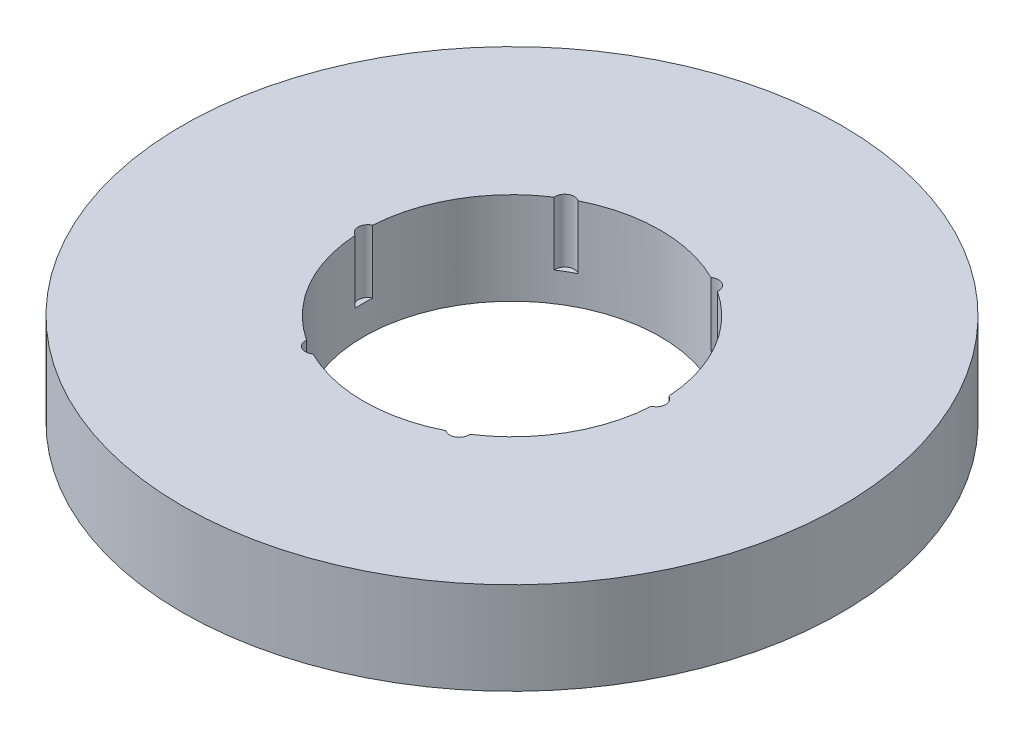
ISO-10303-21;
HEADER;
FILE_DESCRIPTION(('STEP AP214'),'2;1');
FILE_NAME('part.step','',(''),(''),'','','');
FILE_SCHEMA(('AUTOMOTIVE_DESIGN { 1 0 10303 214 1 1 1 1 }'));
ENDSEC;
DATA;
#1=APPLICATION_CONTEXT('core data for automotive mechanical design processes');
#2=APPLICATION_PROTOCOL_DEFINITION('international standard','automotive_design',2000,#1);
#3=PRODUCT_CONTEXT('',#1,'mechanical');
#4=PRODUCT('Part','Part','',(#3));
#5=PRODUCT_RELATED_PRODUCT_CATEGORY('part','',(#4));
#6=PRODUCT_DEFINITION_FORMATION('','',#4);
#7=PRODUCT_DEFINITION_CONTEXT('part definition',#1,'design');
#8=PRODUCT_DEFINITION('design','',#6,#7);
#9=PRODUCT_DEFINITION_SHAPE('','',#8);
#10=(LENGTH_UNIT() NAMED_UNIT(*) SI_UNIT(.MILLI.,.METRE.));
#11=(NAMED_UNIT(*) PLANE_ANGLE_UNIT() SI_UNIT($,.RADIAN.));
#12=(NAMED_UNIT(*) SI_UNIT($,.STERADIAN.) SOLID_ANGLE_UNIT());
#13=UNCERTAINTY_MEASURE_WITH_UNIT(LENGTH_MEASURE(1.E-05),#10,'distance_accuracy_value','');
#14=(GEOMETRIC_REPRESENTATION_CONTEXT(3) GLOBAL_UNCERTAINTY_ASSIGNED_CONTEXT((#13)) GLOBAL_UNIT_ASSIGNED_CONTEXT((#10,
#11,#12)) REPRESENTATION_CONTEXT('',''));
#15=CARTESIAN_POINT('',(0.,0.,0.));
#16=DIRECTION('',(0.,0.,1.));
#17=DIRECTION('',(1.,0.,0.));
#18=AXIS2_PLACEMENT_3D('',#15,#16,#17);
#19=CARTESIAN_POINT('',(0.,28.,0.));
#20=DIRECTION('',(0.,-1.,0.));
#21=DIRECTION('',(0.,0.,-1.));
#22=AXIS2_PLACEMENT_3D('',#19,#20,#21);
#23=CYLINDRICAL_SURFACE('',#22,100.);
#24=CARTESIAN_POINT('',(0.,28.,0.));
#25=DIRECTION('',(0.,1.,0.));
#26=DIRECTION('',(0.,0.,1.));
#27=AXIS2_PLACEMENT_3D('',#24,#25,#26);
#28=CIRCLE('',#27,100.);
#29=CARTESIAN_POINT('',(0.,28.,100.));
#30=VERTEX_POINT('',#29);
#31=EDGE_CURVE('E162',#30,#30,#28,.T.);
#32=ORIENTED_EDGE('',*,*,#31,.F.);
#33=EDGE_LOOP('',(#32));
#34=FACE_BOUND('',#33,.T.);
#35=CARTESIAN_POINT('',(0.,0.,0.));
#36=DIRECTION('',(0.,1.,0.));
#37=DIRECTION('',(0.,0.,1.));
#38=AXIS2_PLACEMENT_3D('',#35,#36,#37);
#39=CIRCLE('',#38,100.);
#40=CARTESIAN_POINT('',(0.,0.,100.));
#41=VERTEX_POINT('',#40);
#42=EDGE_CURVE('E157',#41,#41,#39,.T.);
#43=ORIENTED_EDGE('',*,*,#42,.T.);
#44=EDGE_LOOP('',(#43));
#45=FACE_BOUND('',#44,.T.);
#46=ADVANCED_FACE('F39',(#34,#45),#23,.T.);
#47=CARTESIAN_POINT('',(0.,28.,0.));
#48=DIRECTION('',(0.,1.,0.));
#49=DIRECTION('',(0.,0.,1.));
#50=AXIS2_PLACEMENT_3D('',#47,#48,#49);
#51=PLANE('',#50);
#52=CARTESIAN_POINT('',(-21.8762419223604,28.,-37.8907624881954));
#53=DIRECTION('',(0.,1.,0.));
#54=DIRECTION('',(-0.866025403784433,0.,0.50000000000001));
#55=AXIS2_PLACEMENT_3D('',#52,#53,#54);
#56=CIRCLE('',#55,2.9082454368613);
#57=CARTESIAN_POINT('',(-20.1542428435266,28.,-40.2343944331732));
#58=VERTEX_POINT('',#57);
#59=CARTESIAN_POINT('',(-24.7668862632487,28.,-37.5712835131208));
#60=VERTEX_POINT('',#59);
#61=EDGE_CURVE('E218',#58,#60,#56,.T.);
#62=ORIENTED_EDGE('',*,*,#61,.F.);
#63=CARTESIAN_POINT('',(0.,28.,0.));
#64=DIRECTION('',(0.,1.,0.));
#65=DIRECTION('',(0.,0.,1.));
#66=AXIS2_PLACEMENT_3D('',#63,#64,#65);
#67=CIRCLE('',#66,45.);
#68=CARTESIAN_POINT('',(20.1542428435258,28.,-40.2343944331736));
#69=VERTEX_POINT('',#68);
#70=EDGE_CURVE('E169',#69,#58,#67,.T.);
#71=ORIENTED_EDGE('',*,*,#70,.F.);
#72=CARTESIAN_POINT('',(21.8762419223596,28.,-37.8907624881958));
#73=DIRECTION('',(0.,1.,0.));
#74=DIRECTION('',(-0.866025403784443,0.,-0.499999999999992));
#75=AXIS2_PLACEMENT_3D('',#72,#73,#74);
#76=CIRCLE('',#75,2.9082454368613);
#77=CARTESIAN_POINT('',(24.7668862632479,28.,-37.5712835131213));
#78=VERTEX_POINT('',#77);
#79=EDGE_CURVE('E285',#78,#69,#76,.T.);
#80=ORIENTED_EDGE('',*,*,#79,.F.);
#81=CARTESIAN_POINT('',(44.9211291067744,28.,-2.66311092005232));
#82=VERTEX_POINT('',#81);
#83=EDGE_CURVE('E174',#82,#78,#67,.T.);
#84=ORIENTED_EDGE('',*,*,#83,.F.);
#85=CARTESIAN_POINT('',(43.7524838447198,28.,0.));
#86=DIRECTION('',(0.,1.,0.));
#87=DIRECTION('',(0.,0.,-1.));
#88=AXIS2_PLACEMENT_3D('',#85,#86,#87);
#89=CIRCLE('',#88,2.9082454368613);
#90=CARTESIAN_POINT('',(44.9211291067744,28.,2.66311092005232));
#91=VERTEX_POINT('',#90);
#92=EDGE_CURVE('E280',#91,#82,#89,.T.);
#93=ORIENTED_EDGE('',*,*,#92,.F.);
#94=CARTESIAN_POINT('',(24.7668862632485,28.,37.571283513121));
#95=VERTEX_POINT('',#94);
#96=EDGE_CURVE('E164',#95,#91,#67,.T.);
#97=ORIENTED_EDGE('',*,*,#96,.F.);
#98=CARTESIAN_POINT('',(21.8762419223601,28.,37.8907624881955));
#99=DIRECTION('',(0.,1.,0.));
#100=DIRECTION('',(0.866025403784436,0.,-0.500000000000004));
#101=AXIS2_PLACEMENT_3D('',#98,#99,#100);
#102=CIRCLE('',#101,2.9082454368613);
#103=CARTESIAN_POINT('',(20.1542428435264,28.,40.2343944331733));
#104=VERTEX_POINT('',#103);
#105=EDGE_CURVE('E269',#104,#95,#102,.T.);
#106=ORIENTED_EDGE('',*,*,#105,.F.);
#107=CARTESIAN_POINT('',(-20.1542428435261,28.,40.2343944331734));
#108=VERTEX_POINT('',#107);
#109=EDGE_CURVE('E149',#108,#104,#67,.T.);
#110=ORIENTED_EDGE('',*,*,#109,.F.);
#111=CARTESIAN_POINT('',(-21.8762419223598,28.,37.8907624881957));
#112=DIRECTION('',(0.,1.,0.));
#113=DIRECTION('',(0.86602540378444,0.,0.499999999999998));
#114=AXIS2_PLACEMENT_3D('',#111,#112,#113);
#115=CIRCLE('',#114,2.9082454368613);
#116=CARTESIAN_POINT('',(-24.7668862632482,28.,37.5712835131211));
#117=VERTEX_POINT('',#116);
#118=EDGE_CURVE('E128',#117,#108,#115,.T.);
#119=ORIENTED_EDGE('',*,*,#118,.F.);
#120=CARTESIAN_POINT('',(-44.9211291067744,28.,2.66311092005232));
#121=VERTEX_POINT('',#120);
#122=EDGE_CURVE('E148',#121,#117,#67,.T.);
#123=ORIENTED_EDGE('',*,*,#122,.F.);
#124=CARTESIAN_POINT('',(-43.7524838447198,28.,0.));
#125=DIRECTION('',(0.,1.,0.));
#126=DIRECTION('',(0.,0.,1.));
#127=AXIS2_PLACEMENT_3D('',#124,#125,#126);
#128=CIRCLE('',#127,2.9082454368613);
#129=CARTESIAN_POINT('',(-44.9211291067744,28.,-2.66311092005232));
#130=VERTEX_POINT('',#129);
#131=EDGE_CURVE('E179',#130,#121,#128,.T.);
#132=ORIENTED_EDGE('',*,*,#131,.F.);
#133=EDGE_CURVE('E161',#60,#130,#67,.T.);
#134=ORIENTED_EDGE('',*,*,#133,.F.);
#135=EDGE_LOOP('',(#62,#71,#80,#84,#93,#97,#106,#110,#119,#123,#132,#134));
#136=FACE_BOUND('',#135,.T.);
#137=ORIENTED_EDGE('',*,*,#31,.T.);
#138=EDGE_LOOP('',(#137));
#139=FACE_BOUND('',#138,.T.);
#140=ADVANCED_FACE('F141',(#136,#139),#51,.T.);
#141=CARTESIAN_POINT('',(0.,0.,0.));
#142=DIRECTION('',(0.,1.,0.));
#143=DIRECTION('',(0.,0.,1.));
#144=AXIS2_PLACEMENT_3D('',#141,#142,#143);
#145=PLANE('',#144);
#146=CARTESIAN_POINT('',(0.,0.,0.));
#147=DIRECTION('',(0.,1.,0.));
#148=DIRECTION('',(0.,0.,1.));
#149=AXIS2_PLACEMENT_3D('',#146,#147,#148);
#150=CIRCLE('',#149,45.);
#151=CARTESIAN_POINT('',(0.,0.,45.));
#152=VERTEX_POINT('',#151);
#153=EDGE_CURVE('E166',#152,#152,#150,.T.);
#154=ORIENTED_EDGE('',*,*,#153,.T.);
#155=EDGE_LOOP('',(#154));
#156=FACE_BOUND('',#155,.T.);
#157=ORIENTED_EDGE('',*,*,#42,.F.);
#158=EDGE_LOOP('',(#157));
#159=FACE_BOUND('',#158,.T.);
#160=ADVANCED_FACE('F234',(#156,#159),#145,.F.);
#161=CARTESIAN_POINT('',(0.,28.,0.));
#162=DIRECTION('',(0.,-1.,0.));
#163=DIRECTION('',(0.,0.,-1.));
#164=AXIS2_PLACEMENT_3D('',#161,#162,#163);
#165=CYLINDRICAL_SURFACE('',#164,45.);
#166=DIRECTION('',(0.,1.,0.));
#167=VECTOR('',#166,1.);
#168=CARTESIAN_POINT('',(-20.1542428435266,18.423451855548,-40.2343944331732));
#169=LINE('',#168,#167);
#170=CARTESIAN_POINT('',(-20.1542428435266,8.8469037110961,-40.2343944331732));
#171=VERTEX_POINT('',#170);
#172=EDGE_CURVE('E11',#171,#58,#169,.T.);
#173=ORIENTED_EDGE('',*,*,#172,.F.);
#174=CARTESIAN_POINT('',(0.,8.8469037110961,0.));
#175=DIRECTION('',(0.,1.,0.));
#176=DIRECTION('',(0.,0.,1.));
#177=AXIS2_PLACEMENT_3D('',#174,#175,#176);
#178=CIRCLE('',#177,45.);
#179=CARTESIAN_POINT('',(-24.7668862632487,8.8469037110961,-37.5712835131208));
#180=VERTEX_POINT('',#179);
#181=EDGE_CURVE('E214',#171,#180,#178,.T.);
#182=ORIENTED_EDGE('',*,*,#181,.T.);
#183=DIRECTION('',(0.,1.,0.));
#184=VECTOR('',#183,1.);
#185=CARTESIAN_POINT('',(-24.7668862632487,18.423451855548,-37.5712835131208));
#186=LINE('',#185,#184);
#187=EDGE_CURVE('E46',#60,#180,#186,.F.);
#188=ORIENTED_EDGE('',*,*,#187,.F.);
#189=ORIENTED_EDGE('',*,*,#133,.T.);
#190=DIRECTION('',(0.,1.,0.));
#191=VECTOR('',#190,1.);
#192=CARTESIAN_POINT('',(-44.9211291067744,18.423451855548,-2.66311092005232));
#193=LINE('',#192,#191);
#194=CARTESIAN_POINT('',(-44.9211291067744,8.8469037110961,-2.66311092005232));
#195=VERTEX_POINT('',#194);
#196=EDGE_CURVE('E187',#195,#130,#193,.T.);
#197=ORIENTED_EDGE('',*,*,#196,.F.);
#198=CARTESIAN_POINT('',(0.,8.8469037110961,0.));
#199=DIRECTION('',(0.,1.,0.));
#200=DIRECTION('',(0.,0.,1.));
#201=AXIS2_PLACEMENT_3D('',#198,#199,#200);
#202=CIRCLE('',#201,45.);
#203=CARTESIAN_POINT('',(-44.9211291067744,8.8469037110961,2.66311092005232));
#204=VERTEX_POINT('',#203);
#205=EDGE_CURVE('E184',#195,#204,#202,.T.);
#206=ORIENTED_EDGE('',*,*,#205,.T.);
#207=DIRECTION('',(0.,1.,0.));
#208=VECTOR('',#207,1.);
#209=CARTESIAN_POINT('',(-44.9211291067744,18.423451855548,2.66311092005232));
#210=LINE('',#209,#208);
#211=EDGE_CURVE('E158',#121,#204,#210,.F.);
#212=ORIENTED_EDGE('',*,*,#211,.F.);
#213=ORIENTED_EDGE('',*,*,#122,.T.);
#214=DIRECTION('',(0.,1.,0.));
#215=VECTOR('',#214,1.);
#216=CARTESIAN_POINT('',(-24.7668862632482,18.423451855548,37.5712835131211));
#217=LINE('',#216,#215);
#218=CARTESIAN_POINT('',(-24.7668862632482,8.8469037110961,37.5712835131211));
#219=VERTEX_POINT('',#218);
#220=EDGE_CURVE('E127',#219,#117,#217,.T.);
#221=ORIENTED_EDGE('',*,*,#220,.F.);
#222=CARTESIAN_POINT('',(0.,8.8469037110961,0.));
#223=DIRECTION('',(0.,1.,0.));
#224=DIRECTION('',(0.,0.,1.));
#225=AXIS2_PLACEMENT_3D('',#222,#223,#224);
#226=CIRCLE('',#225,45.);
#227=CARTESIAN_POINT('',(-20.1542428435261,8.8469037110961,40.2343944331734));
#228=VERTEX_POINT('',#227);
#229=EDGE_CURVE('E189',#219,#228,#226,.T.);
#230=ORIENTED_EDGE('',*,*,#229,.T.);
#231=DIRECTION('',(0.,1.,0.));
#232=VECTOR('',#231,1.);
#233=CARTESIAN_POINT('',(-20.1542428435261,18.423451855548,40.2343944331734));
#234=LINE('',#233,#232);
#235=EDGE_CURVE('E140',#108,#228,#234,.F.);
#236=ORIENTED_EDGE('',*,*,#235,.F.);
#237=ORIENTED_EDGE('',*,*,#109,.T.);
#238=DIRECTION('',(0.,1.,0.));
#239=VECTOR('',#238,1.);
#240=CARTESIAN_POINT('',(20.1542428435264,18.423451855548,40.2343944331733));
#241=LINE('',#240,#239);
#242=CARTESIAN_POINT('',(20.1542428435264,8.8469037110961,40.2343944331733));
#243=VERTEX_POINT('',#242);
#244=EDGE_CURVE('E196',#243,#104,#241,.T.);
#245=ORIENTED_EDGE('',*,*,#244,.F.);
#246=CARTESIAN_POINT('',(0.,8.8469037110961,0.));
#247=DIRECTION('',(0.,1.,0.));
#248=DIRECTION('',(0.,0.,1.));
#249=AXIS2_PLACEMENT_3D('',#246,#247,#248);
#250=CIRCLE('',#249,45.);
#251=CARTESIAN_POINT('',(24.7668862632485,8.8469037110961,37.571283513121));
#252=VERTEX_POINT('',#251);
#253=EDGE_CURVE('E136',#243,#252,#250,.T.);
#254=ORIENTED_EDGE('',*,*,#253,.T.);
#255=DIRECTION('',(0.,1.,0.));
#256=VECTOR('',#255,1.);
#257=CARTESIAN_POINT('',(24.7668862632485,18.423451855548,37.571283513121));
#258=LINE('',#257,#256);
#259=EDGE_CURVE('E194',#95,#252,#258,.F.);
#260=ORIENTED_EDGE('',*,*,#259,.F.);
#261=ORIENTED_EDGE('',*,*,#96,.T.);
#262=DIRECTION('',(0.,1.,0.));
#263=VECTOR('',#262,1.);
#264=CARTESIAN_POINT('',(44.9211291067744,18.423451855548,2.66311092005232));
#265=LINE('',#264,#263);
#266=CARTESIAN_POINT('',(44.9211291067744,8.8469037110961,2.66311092005232));
#267=VERTEX_POINT('',#266);
#268=EDGE_CURVE('E206',#267,#91,#265,.T.);
#269=ORIENTED_EDGE('',*,*,#268,.F.);
#270=CARTESIAN_POINT('',(0.,8.8469037110961,0.));
#271=DIRECTION('',(0.,1.,0.));
#272=DIRECTION('',(0.,0.,1.));
#273=AXIS2_PLACEMENT_3D('',#270,#271,#272);
#274=CIRCLE('',#273,45.);
#275=CARTESIAN_POINT('',(44.9211291067744,8.8469037110961,-2.66311092005232));
#276=VERTEX_POINT('',#275);
#277=EDGE_CURVE('E199',#267,#276,#274,.T.);
#278=ORIENTED_EDGE('',*,*,#277,.T.);
#279=DIRECTION('',(0.,1.,0.));
#280=VECTOR('',#279,1.);
#281=CARTESIAN_POINT('',(44.9211291067744,18.423451855548,-2.66311092005232));
#282=LINE('',#281,#280);
#283=EDGE_CURVE('E201',#82,#276,#282,.F.);
#284=ORIENTED_EDGE('',*,*,#283,.F.);
#285=ORIENTED_EDGE('',*,*,#83,.T.);
#286=DIRECTION('',(0.,1.,0.));
#287=VECTOR('',#286,1.);
#288=CARTESIAN_POINT('',(24.7668862632479,18.423451855548,-37.5712835131213));
#289=LINE('',#288,#287);
#290=CARTESIAN_POINT('',(24.7668862632479,8.8469037110961,-37.5712835131213));
#291=VERTEX_POINT('',#290);
#292=EDGE_CURVE('E213',#291,#78,#289,.T.);
#293=ORIENTED_EDGE('',*,*,#292,.F.);
#294=CARTESIAN_POINT('',(0.,8.8469037110961,0.));
#295=DIRECTION('',(0.,1.,0.));
#296=DIRECTION('',(0.,0.,1.));
#297=AXIS2_PLACEMENT_3D('',#294,#295,#296);
#298=CIRCLE('',#297,45.);
#299=CARTESIAN_POINT('',(20.1542428435258,8.8469037110961,-40.2343944331736));
#300=VERTEX_POINT('',#299);
#301=EDGE_CURVE('E208',#291,#300,#298,.T.);
#302=ORIENTED_EDGE('',*,*,#301,.T.);
#303=DIRECTION('',(0.,1.,0.));
#304=VECTOR('',#303,1.);
#305=CARTESIAN_POINT('',(20.1542428435258,18.423451855548,-40.2343944331736));
#306=LINE('',#305,#304);
#307=EDGE_CURVE('E211',#69,#300,#306,.F.);
#308=ORIENTED_EDGE('',*,*,#307,.F.);
#309=ORIENTED_EDGE('',*,*,#70,.T.);
#310=EDGE_LOOP('',(#173,#182,#188,#189,#197,#206,#212,#213,#221,#230,#236,#237,#245,#254,#260,
#261,#269,#278,#284,#285,#293,#302,#308,#309));
#311=FACE_BOUND('',#310,.T.);
#312=ORIENTED_EDGE('',*,*,#153,.F.);
#313=EDGE_LOOP('',(#312));
#314=FACE_BOUND('',#313,.T.);
#315=ADVANCED_FACE('F152',(#311,#314),#165,.F.);
#316=CARTESIAN_POINT('',(-43.7524838447198,8.8469037110961,0.));
#317=DIRECTION('',(0.,1.,0.));
#318=DIRECTION('',(0.,0.,1.));
#319=AXIS2_PLACEMENT_3D('',#316,#317,#318);
#320=CYLINDRICAL_SURFACE('',#319,2.9082454368613);
#321=ORIENTED_EDGE('',*,*,#196,.T.);
#322=ORIENTED_EDGE('',*,*,#131,.T.);
#323=ORIENTED_EDGE('',*,*,#211,.T.);
#324=CARTESIAN_POINT('',(-43.7524838447198,8.8469037110961,0.));
#325=DIRECTION('',(0.,1.,0.));
#326=DIRECTION('',(0.,0.,1.));
#327=AXIS2_PLACEMENT_3D('',#324,#325,#326);
#328=CIRCLE('',#327,2.9082454368613);
#329=EDGE_CURVE('E180',#195,#204,#328,.T.);
#330=ORIENTED_EDGE('',*,*,#329,.F.);
#331=EDGE_LOOP('',(#321,#322,#323,#330));
#332=FACE_BOUND('',#331,.T.);
#333=ADVANCED_FACE('F244',(#332),#320,.F.);
#334=CARTESIAN_POINT('',(-43.7524838447198,8.8469037110961,0.));
#335=DIRECTION('',(0.,1.,0.));
#336=DIRECTION('',(0.,0.,1.));
#337=AXIS2_PLACEMENT_3D('',#334,#335,#336);
#338=PLANE('',#337);
#339=ORIENTED_EDGE('',*,*,#329,.T.);
#340=ORIENTED_EDGE('',*,*,#205,.F.);
#341=EDGE_LOOP('',(#339,#340));
#342=FACE_BOUND('',#341,.T.);
#343=ADVANCED_FACE('F248',(#342),#338,.T.);
#344=CARTESIAN_POINT('',(-21.8762419223598,8.8469037110961,37.8907624881957));
#345=DIRECTION('',(0.,1.,0.));
#346=DIRECTION('',(0.,0.,1.));
#347=AXIS2_PLACEMENT_3D('',#344,#345,#346);
#348=CYLINDRICAL_SURFACE('',#347,2.9082454368613);
#349=ORIENTED_EDGE('',*,*,#220,.T.);
#350=ORIENTED_EDGE('',*,*,#118,.T.);
#351=ORIENTED_EDGE('',*,*,#235,.T.);
#352=CARTESIAN_POINT('',(-21.8762419223598,8.8469037110961,37.8907624881957));
#353=DIRECTION('',(0.,1.,0.));
#354=DIRECTION('',(0.86602540378444,0.,0.499999999999998));
#355=AXIS2_PLACEMENT_3D('',#352,#353,#354);
#356=CIRCLE('',#355,2.9082454368613);
#357=EDGE_CURVE('E135',#219,#228,#356,.T.);
#358=ORIENTED_EDGE('',*,*,#357,.F.);
#359=EDGE_LOOP('',(#349,#350,#351,#358));
#360=FACE_BOUND('',#359,.T.);
#361=ADVANCED_FACE('F126',(#360),#348,.F.);
#362=CARTESIAN_POINT('',(-21.8762419223598,8.8469037110961,37.8907624881957));
#363=DIRECTION('',(0.,1.,0.));
#364=DIRECTION('',(0.86602540378444,0.,0.499999999999998));
#365=AXIS2_PLACEMENT_3D('',#362,#363,#364);
#366=PLANE('',#365);
#367=ORIENTED_EDGE('',*,*,#357,.T.);
#368=ORIENTED_EDGE('',*,*,#229,.F.);
#369=EDGE_LOOP('',(#367,#368));
#370=FACE_BOUND('',#369,.T.);
#371=ADVANCED_FACE('F258',(#370),#366,.T.);
#372=CARTESIAN_POINT('',(21.8762419223601,8.8469037110961,37.8907624881955));
#373=DIRECTION('',(0.,1.,0.));
#374=DIRECTION('',(0.,0.,1.));
#375=AXIS2_PLACEMENT_3D('',#372,#373,#374);
#376=CYLINDRICAL_SURFACE('',#375,2.9082454368613);
#377=ORIENTED_EDGE('',*,*,#244,.T.);
#378=ORIENTED_EDGE('',*,*,#105,.T.);
#379=ORIENTED_EDGE('',*,*,#259,.T.);
#380=CARTESIAN_POINT('',(21.8762419223601,8.8469037110961,37.8907624881955));
#381=DIRECTION('',(0.,1.,0.));
#382=DIRECTION('',(0.866025403784436,0.,-0.500000000000004));
#383=AXIS2_PLACEMENT_3D('',#380,#381,#382);
#384=CIRCLE('',#383,2.9082454368613);
#385=EDGE_CURVE('E147',#243,#252,#384,.T.);
#386=ORIENTED_EDGE('',*,*,#385,.F.);
#387=EDGE_LOOP('',(#377,#378,#379,#386));
#388=FACE_BOUND('',#387,.T.);
#389=ADVANCED_FACE('F256',(#388),#376,.F.);
#390=CARTESIAN_POINT('',(21.8762419223601,8.8469037110961,37.8907624881955));
#391=DIRECTION('',(0.,1.,0.));
#392=DIRECTION('',(0.866025403784436,0.,-0.500000000000004));
#393=AXIS2_PLACEMENT_3D('',#390,#391,#392);
#394=PLANE('',#393);
#395=ORIENTED_EDGE('',*,*,#385,.T.);
#396=ORIENTED_EDGE('',*,*,#253,.F.);
#397=EDGE_LOOP('',(#395,#396));
#398=FACE_BOUND('',#397,.T.);
#399=ADVANCED_FACE('F263',(#398),#394,.T.);
#400=CARTESIAN_POINT('',(43.7524838447198,8.8469037110961,0.));
#401=DIRECTION('',(0.,1.,0.));
#402=DIRECTION('',(0.,0.,1.));
#403=AXIS2_PLACEMENT_3D('',#400,#401,#402);
#404=CYLINDRICAL_SURFACE('',#403,2.9082454368613);
#405=ORIENTED_EDGE('',*,*,#268,.T.);
#406=ORIENTED_EDGE('',*,*,#92,.T.);
#407=ORIENTED_EDGE('',*,*,#283,.T.);
#408=CARTESIAN_POINT('',(43.7524838447198,8.8469037110961,0.));
#409=DIRECTION('',(0.,1.,0.));
#410=DIRECTION('',(0.,0.,-1.));
#411=AXIS2_PLACEMENT_3D('',#408,#409,#410);
#412=CIRCLE('',#411,2.9082454368613);
#413=EDGE_CURVE('E273',#267,#276,#412,.T.);
#414=ORIENTED_EDGE('',*,*,#413,.F.);
#415=EDGE_LOOP('',(#405,#406,#407,#414));
#416=FACE_BOUND('',#415,.T.);
#417=ADVANCED_FACE('F297',(#416),#404,.F.);
#418=CARTESIAN_POINT('',(43.7524838447198,8.8469037110961,0.));
#419=DIRECTION('',(0.,1.,0.));
#420=DIRECTION('',(0.,0.,-1.));
#421=AXIS2_PLACEMENT_3D('',#418,#419,#420);
#422=PLANE('',#421);
#423=ORIENTED_EDGE('',*,*,#413,.T.);
#424=ORIENTED_EDGE('',*,*,#277,.F.);
#425=EDGE_LOOP('',(#423,#424));
#426=FACE_BOUND('',#425,.T.);
#427=ADVANCED_FACE('F299',(#426),#422,.T.);
#428=CARTESIAN_POINT('',(21.8762419223596,8.8469037110961,-37.8907624881958));
#429=DIRECTION('',(0.,1.,0.));
#430=DIRECTION('',(0.,0.,1.));
#431=AXIS2_PLACEMENT_3D('',#428,#429,#430);
#432=CYLINDRICAL_SURFACE('',#431,2.9082454368613);
#433=ORIENTED_EDGE('',*,*,#292,.T.);
#434=ORIENTED_EDGE('',*,*,#79,.T.);
#435=ORIENTED_EDGE('',*,*,#307,.T.);
#436=CARTESIAN_POINT('',(21.8762419223596,8.8469037110961,-37.8907624881958));
#437=DIRECTION('',(0.,1.,0.));
#438=DIRECTION('',(-0.866025403784443,0.,-0.499999999999992));
#439=AXIS2_PLACEMENT_3D('',#436,#437,#438);
#440=CIRCLE('',#439,2.9082454368613);
#441=EDGE_CURVE('E56',#291,#300,#440,.T.);
#442=ORIENTED_EDGE('',*,*,#441,.F.);
#443=EDGE_LOOP('',(#433,#434,#435,#442));
#444=FACE_BOUND('',#443,.T.);
#445=ADVANCED_FACE('F292',(#444),#432,.F.);
#446=CARTESIAN_POINT('',(21.8762419223596,8.8469037110961,-37.8907624881958));
#447=DIRECTION('',(0.,1.,0.));
#448=DIRECTION('',(-0.866025403784443,0.,-0.499999999999992));
#449=AXIS2_PLACEMENT_3D('',#446,#447,#448);
#450=PLANE('',#449);
#451=ORIENTED_EDGE('',*,*,#441,.T.);
#452=ORIENTED_EDGE('',*,*,#301,.F.);
#453=EDGE_LOOP('',(#451,#452));
#454=FACE_BOUND('',#453,.T.);
#455=ADVANCED_FACE('F226',(#454),#450,.T.);
#456=CARTESIAN_POINT('',(-21.8762419223604,8.8469037110961,-37.8907624881954));
#457=DIRECTION('',(0.,1.,0.));
#458=DIRECTION('',(0.,0.,1.));
#459=AXIS2_PLACEMENT_3D('',#456,#457,#458);
#460=CYLINDRICAL_SURFACE('',#459,2.9082454368613);
#461=ORIENTED_EDGE('',*,*,#172,.T.);
#462=ORIENTED_EDGE('',*,*,#61,.T.);
#463=ORIENTED_EDGE('',*,*,#187,.T.);
#464=CARTESIAN_POINT('',(-21.8762419223604,8.8469037110961,-37.8907624881954));
#465=DIRECTION('',(0.,1.,0.));
#466=DIRECTION('',(-0.866025403784433,0.,0.50000000000001));
#467=AXIS2_PLACEMENT_3D('',#464,#465,#466);
#468=CIRCLE('',#467,2.9082454368613);
#469=EDGE_CURVE('E55',#171,#180,#468,.T.);
#470=ORIENTED_EDGE('',*,*,#469,.F.);
#471=EDGE_LOOP('',(#461,#462,#463,#470));
#472=FACE_BOUND('',#471,.T.);
#473=ADVANCED_FACE('F217',(#472),#460,.F.);
#474=CARTESIAN_POINT('',(-21.8762419223604,8.8469037110961,-37.8907624881954));
#475=DIRECTION('',(0.,1.,0.));
#476=DIRECTION('',(-0.866025403784433,0.,0.50000000000001));
#477=AXIS2_PLACEMENT_3D('',#474,#475,#476);
#478=PLANE('',#477);
#479=ORIENTED_EDGE('',*,*,#469,.T.);
#480=ORIENTED_EDGE('',*,*,#181,.F.);
#481=EDGE_LOOP('',(#479,#480));
#482=FACE_BOUND('',#481,.T.);
#483=ADVANCED_FACE('F219',(#482),#478,.T.);
#484=CLOSED_SHELL('',(#46,#140,#160,#315,#333,#343,#361,#371,#389,#399,#417,#427,#445,#455,#473,#483));
#485=MANIFOLD_SOLID_BREP('B2',#484);
#486=ADVANCED_BREP_SHAPE_REPRESENTATION('',(#18,#485),#14);
#487=SHAPE_DEFINITION_REPRESENTATION(#9,#486);
ENDSEC;
END-ISO-10303-21;
